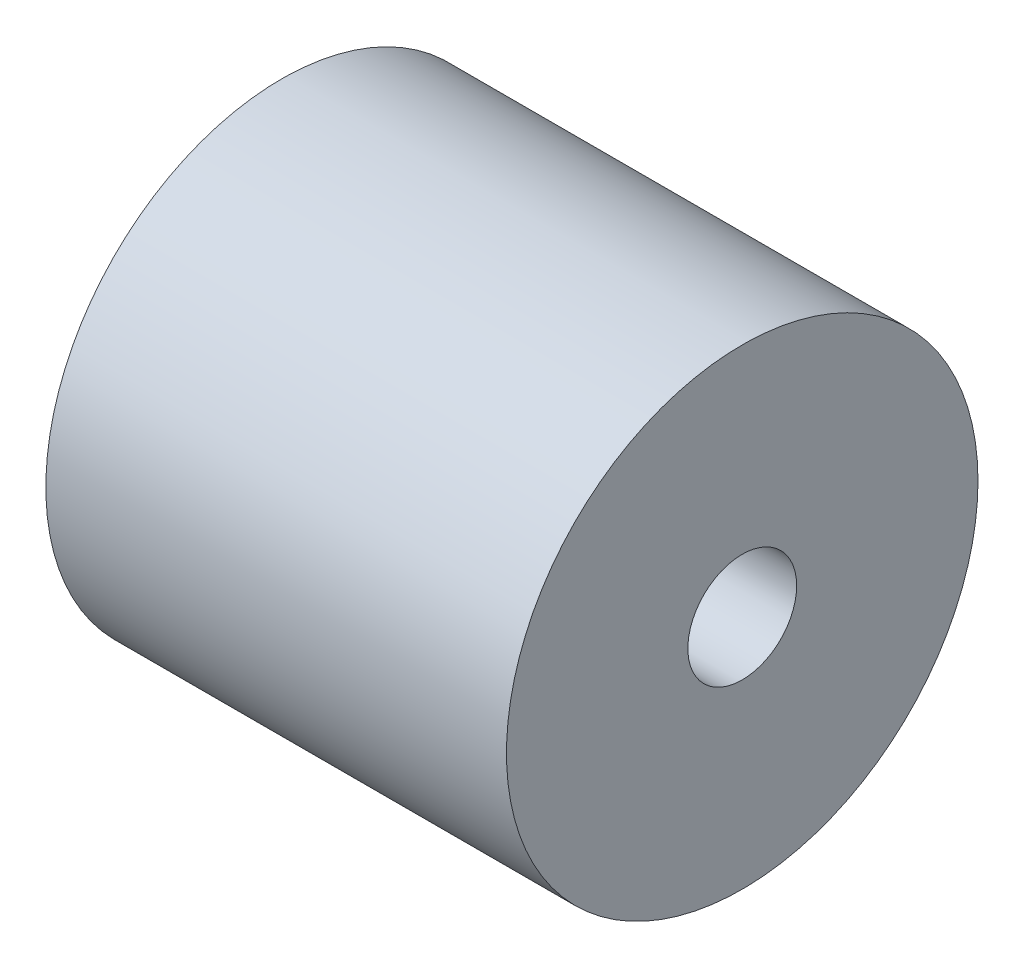
ISO-10303-21;
HEADER;
FILE_DESCRIPTION(('STEP AP214'),'2;1');
FILE_NAME('part.step','',(''),(''),'','','');
FILE_SCHEMA(('AUTOMOTIVE_DESIGN { 1 0 10303 214 1 1 1 1 }'));
ENDSEC;
DATA;
#1=APPLICATION_CONTEXT('core data for automotive mechanical design processes');
#2=APPLICATION_PROTOCOL_DEFINITION('international standard','automotive_design',2000,#1);
#3=PRODUCT_CONTEXT('',#1,'mechanical');
#4=PRODUCT('Part','Part','',(#3));
#5=PRODUCT_RELATED_PRODUCT_CATEGORY('part','',(#4));
#6=PRODUCT_DEFINITION_FORMATION('','',#4);
#7=PRODUCT_DEFINITION_CONTEXT('part definition',#1,'design');
#8=PRODUCT_DEFINITION('design','',#6,#7);
#9=PRODUCT_DEFINITION_SHAPE('','',#8);
#10=(LENGTH_UNIT() NAMED_UNIT(*) SI_UNIT(.MILLI.,.METRE.));
#11=(NAMED_UNIT(*) PLANE_ANGLE_UNIT() SI_UNIT($,.RADIAN.));
#12=(NAMED_UNIT(*) SI_UNIT($,.STERADIAN.) SOLID_ANGLE_UNIT());
#13=UNCERTAINTY_MEASURE_WITH_UNIT(LENGTH_MEASURE(1.E-05),#10,'distance_accuracy_value','');
#14=(GEOMETRIC_REPRESENTATION_CONTEXT(3) GLOBAL_UNCERTAINTY_ASSIGNED_CONTEXT((#13)) GLOBAL_UNIT_ASSIGNED_CONTEXT((#10,
#11,#12)) REPRESENTATION_CONTEXT('',''));
#15=CARTESIAN_POINT('',(0.,0.,0.));
#16=DIRECTION('',(0.,0.,1.));
#17=DIRECTION('',(1.,0.,0.));
#18=AXIS2_PLACEMENT_3D('',#15,#16,#17);
#19=CARTESIAN_POINT('',(12.7,0.,0.));
#20=DIRECTION('',(1.,0.,0.));
#21=DIRECTION('',(0.,0.,-1.));
#22=AXIS2_PLACEMENT_3D('',#19,#20,#21);
#23=PLANE('',#22);
#24=CARTESIAN_POINT('',(12.7,0.,0.));
#25=DIRECTION('',(1.,0.,0.));
#26=DIRECTION('',(0.,0.,-1.));
#27=AXIS2_PLACEMENT_3D('',#24,#25,#26);
#28=CIRCLE('',#27,6.5);
#29=CARTESIAN_POINT('',(12.7,0.,-6.5));
#30=VERTEX_POINT('',#29);
#31=EDGE_CURVE('E10',#30,#30,#28,.T.);
#32=ORIENTED_EDGE('',*,*,#31,.T.);
#33=EDGE_LOOP('',(#32));
#34=FACE_BOUND('',#33,.T.);
#35=CARTESIAN_POINT('',(12.7,0.,0.));
#36=DIRECTION('',(1.,0.,0.));
#37=DIRECTION('',(0.,0.,-1.));
#38=AXIS2_PLACEMENT_3D('',#35,#36,#37);
#39=CIRCLE('',#38,1.5);
#40=CARTESIAN_POINT('',(12.7,0.,-1.5));
#41=VERTEX_POINT('',#40);
#42=EDGE_CURVE('E41',#41,#41,#39,.T.);
#43=ORIENTED_EDGE('',*,*,#42,.F.);
#44=EDGE_LOOP('',(#43));
#45=FACE_BOUND('',#44,.T.);
#46=ADVANCED_FACE('F30',(#34,#45),#23,.T.);
#47=CARTESIAN_POINT('',(0.,0.,0.));
#48=DIRECTION('',(1.,0.,0.));
#49=DIRECTION('',(0.,0.,-1.));
#50=AXIS2_PLACEMENT_3D('',#47,#48,#49);
#51=PLANE('',#50);
#52=CARTESIAN_POINT('',(0.,0.,0.));
#53=DIRECTION('',(1.,0.,0.));
#54=DIRECTION('',(0.,0.,-1.));
#55=AXIS2_PLACEMENT_3D('',#52,#53,#54);
#56=CIRCLE('',#55,6.5);
#57=CARTESIAN_POINT('',(0.,0.,-6.5));
#58=VERTEX_POINT('',#57);
#59=EDGE_CURVE('E34',#58,#58,#56,.T.);
#60=ORIENTED_EDGE('',*,*,#59,.F.);
#61=EDGE_LOOP('',(#60));
#62=FACE_BOUND('',#61,.T.);
#63=CARTESIAN_POINT('',(0.,0.,0.));
#64=DIRECTION('',(1.,0.,0.));
#65=DIRECTION('',(0.,0.,-1.));
#66=AXIS2_PLACEMENT_3D('',#63,#64,#65);
#67=CIRCLE('',#66,1.5);
#68=CARTESIAN_POINT('',(0.,0.,-1.5));
#69=VERTEX_POINT('',#68);
#70=EDGE_CURVE('E43',#69,#69,#67,.T.);
#71=ORIENTED_EDGE('',*,*,#70,.T.);
#72=EDGE_LOOP('',(#71));
#73=FACE_BOUND('',#72,.T.);
#74=ADVANCED_FACE('F53',(#62,#73),#51,.F.);
#75=CARTESIAN_POINT('',(12.7,0.,0.));
#76=DIRECTION('',(-1.,0.,0.));
#77=DIRECTION('',(0.,0.,1.));
#78=AXIS2_PLACEMENT_3D('',#75,#76,#77);
#79=CYLINDRICAL_SURFACE('',#78,6.5);
#80=ORIENTED_EDGE('',*,*,#31,.F.);
#81=EDGE_LOOP('',(#80));
#82=FACE_BOUND('',#81,.T.);
#83=ORIENTED_EDGE('',*,*,#59,.T.);
#84=EDGE_LOOP('',(#83));
#85=FACE_BOUND('',#84,.T.);
#86=ADVANCED_FACE('F32',(#82,#85),#79,.T.);
#87=CARTESIAN_POINT('',(12.7,0.,0.));
#88=DIRECTION('',(-1.,0.,0.));
#89=DIRECTION('',(0.,0.,1.));
#90=AXIS2_PLACEMENT_3D('',#87,#88,#89);
#91=CYLINDRICAL_SURFACE('',#90,1.5);
#92=ORIENTED_EDGE('',*,*,#42,.T.);
#93=EDGE_LOOP('',(#92));
#94=FACE_BOUND('',#93,.T.);
#95=ORIENTED_EDGE('',*,*,#70,.F.);
#96=EDGE_LOOP('',(#95));
#97=FACE_BOUND('',#96,.T.);
#98=ADVANCED_FACE('F49',(#94,#97),#91,.F.);
#99=CLOSED_SHELL('',(#46,#74,#86,#98));
#100=MANIFOLD_SOLID_BREP('B2',#99);
#101=ADVANCED_BREP_SHAPE_REPRESENTATION('',(#18,#100),#14);
#102=SHAPE_DEFINITION_REPRESENTATION(#9,#101);
ENDSEC;
END-ISO-10303-21;
